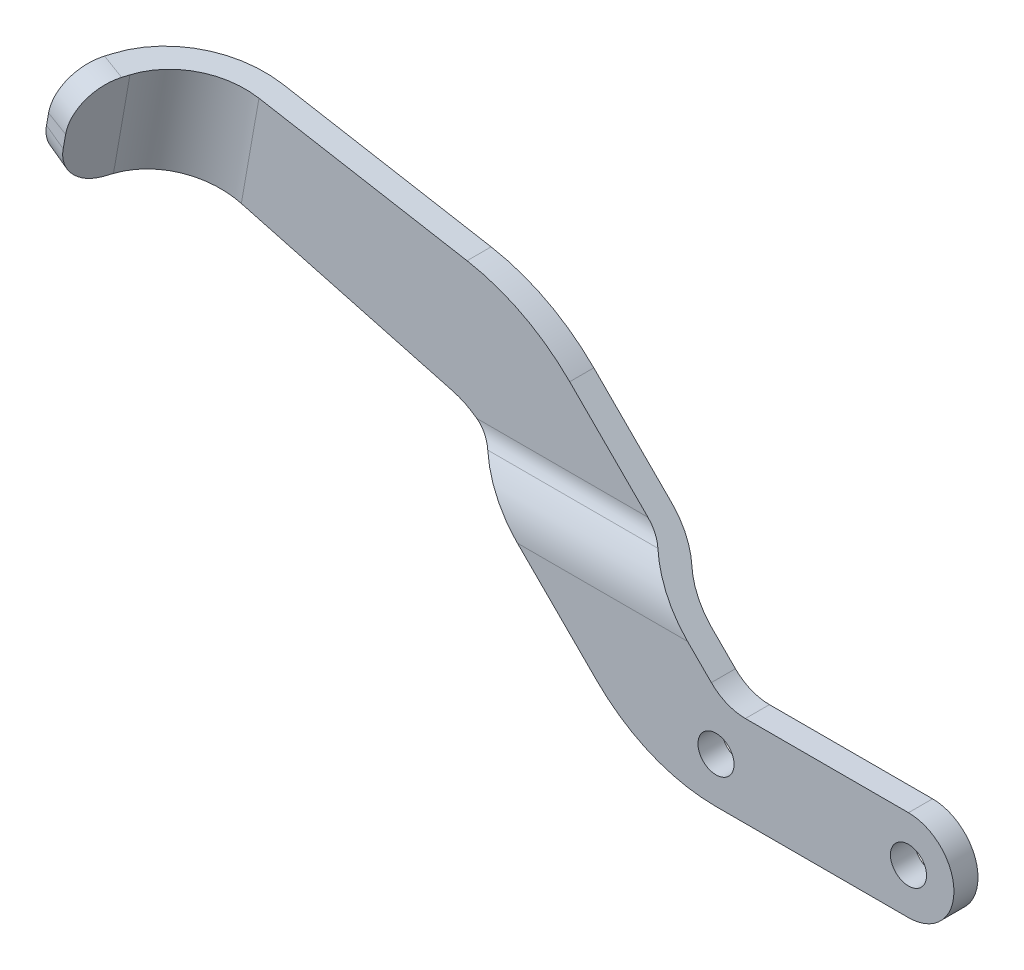
ISO-10303-21;
HEADER;
FILE_DESCRIPTION(('STEP AP214'),'2;1');
FILE_NAME('part.step','',(''),(''),'','','');
FILE_SCHEMA(('AUTOMOTIVE_DESIGN { 1 0 10303 214 1 1 1 1 }'));
ENDSEC;
DATA;
#1=APPLICATION_CONTEXT('core data for automotive mechanical design processes');
#2=APPLICATION_PROTOCOL_DEFINITION('international standard','automotive_design',2000,#1);
#3=PRODUCT_CONTEXT('',#1,'mechanical');
#4=PRODUCT('Part','Part','',(#3));
#5=PRODUCT_RELATED_PRODUCT_CATEGORY('part','',(#4));
#6=PRODUCT_DEFINITION_FORMATION('','',#4);
#7=PRODUCT_DEFINITION_CONTEXT('part definition',#1,'design');
#8=PRODUCT_DEFINITION('design','',#6,#7);
#9=PRODUCT_DEFINITION_SHAPE('','',#8);
#10=(LENGTH_UNIT() NAMED_UNIT(*) SI_UNIT(.MILLI.,.METRE.));
#11=(NAMED_UNIT(*) PLANE_ANGLE_UNIT() SI_UNIT($,.RADIAN.));
#12=(NAMED_UNIT(*) SI_UNIT($,.STERADIAN.) SOLID_ANGLE_UNIT());
#13=UNCERTAINTY_MEASURE_WITH_UNIT(LENGTH_MEASURE(1.E-05),#10,'distance_accuracy_value','');
#14=(GEOMETRIC_REPRESENTATION_CONTEXT(3) GLOBAL_UNCERTAINTY_ASSIGNED_CONTEXT((#13)) GLOBAL_UNIT_ASSIGNED_CONTEXT((#10,
#11,#12)) REPRESENTATION_CONTEXT('',''));
#15=CARTESIAN_POINT('',(0.,0.,0.));
#16=DIRECTION('',(0.,0.,1.));
#17=DIRECTION('',(1.,0.,0.));
#18=AXIS2_PLACEMENT_3D('',#15,#16,#17);
#19=CARTESIAN_POINT('',(-26.0151280605346,7.85987193946543,3.175));
#20=DIRECTION('',(-0.707106781186549,-0.707106781186546,0.));
#21=DIRECTION('',(0.707106781186546,-0.707106781186549,0.));
#22=AXIS2_PLACEMENT_3D('',#19,#20,#21);
#23=PLANE('',#22);
#24=CARTESIAN_POINT('',(-29.1549957084391,10.9997395873699,-6.35));
#25=DIRECTION('',(-0.707106781186549,-0.707106781186546,0.));
#26=DIRECTION('',(0.707106781186546,-0.707106781186549,0.));
#27=AXIS2_PLACEMENT_3D('',#24,#25,#26);
#28=ELLIPSE('',#27,13.4703841816037,9.525);
#29=CARTESIAN_POINT('',(-29.1549957084391,10.9997395873699,3.175));
#30=VERTEX_POINT('',#29);
#31=CARTESIAN_POINT('',(-35.4551910179116,17.2999348968425,0.793750000000002));
#32=VERTEX_POINT('',#31);
#33=EDGE_CURVE('E259',#30,#32,#28,.T.);
#34=ORIENTED_EDGE('',*,*,#33,.F.);
#35=DIRECTION('',(-0.707106781186546,0.707106781186549,0.));
#36=VECTOR('',#35,1.);
#37=CARTESIAN_POINT('',(-26.0151280605346,7.85987193946543,3.175));
#38=LINE('',#37,#36);
#39=CARTESIAN_POINT('',(-26.0151280605346,7.85987193946543,3.175));
#40=VERTEX_POINT('',#39);
#41=EDGE_CURVE('E337',#40,#30,#38,.T.);
#42=ORIENTED_EDGE('',*,*,#41,.F.);
#43=DIRECTION('',(0.,0.,-1.));
#44=VECTOR('',#43,1.);
#45=CARTESIAN_POINT('',(-26.0151280605346,7.85987193946543,3.175));
#46=LINE('',#45,#44);
#47=CARTESIAN_POINT('',(-26.0151280605346,7.85987193946543,0.));
#48=VERTEX_POINT('',#47);
#49=EDGE_CURVE('E369',#40,#48,#46,.T.);
#50=ORIENTED_EDGE('',*,*,#49,.T.);
#51=DIRECTION('',(-0.707106781186546,0.707106781186549,0.));
#52=VECTOR('',#51,1.);
#53=CARTESIAN_POINT('',(-26.0151280605346,7.85987193946543,0.));
#54=LINE('',#53,#52);
#55=CARTESIAN_POINT('',(-29.1549957084391,10.9997395873699,0.));
#56=VERTEX_POINT('',#55);
#57=EDGE_CURVE('E312',#48,#56,#54,.T.);
#58=ORIENTED_EDGE('',*,*,#57,.T.);
#59=CARTESIAN_POINT('',(-29.1549957084391,10.9997395873699,-6.35));
#60=DIRECTION('',(-0.707106781186549,-0.707106781186546,0.));
#61=DIRECTION('',(-0.707106781186546,0.707106781186549,0.));
#62=AXIS2_PLACEMENT_3D('',#59,#60,#61);
#63=ELLIPSE('',#62,8.98025612106914,6.35);
#64=CARTESIAN_POINT('',(-33.3551259147541,15.199869793685,-1.5875));
#65=VERTEX_POINT('',#64);
#66=EDGE_CURVE('E322',#56,#65,#63,.T.);
#67=ORIENTED_EDGE('',*,*,#66,.T.);
#68=CARTESIAN_POINT('',(-37.5552561210691,19.4,3.175));
#69=DIRECTION('',(-0.707106781186549,-0.707106781186546,0.));
#70=DIRECTION('',(-0.707106781186546,0.707106781186549,0.));
#71=AXIS2_PLACEMENT_3D('',#68,#69,#70);
#72=ELLIPSE('',#71,8.98025612106914,6.35);
#73=CARTESIAN_POINT('',(-37.5552561210691,19.4,-3.175));
#74=VERTEX_POINT('',#73);
#75=EDGE_CURVE('E302',#65,#74,#72,.F.);
#76=ORIENTED_EDGE('',*,*,#75,.T.);
#77=DIRECTION('',(-0.707106781186546,0.707106781186549,0.));
#78=VECTOR('',#77,1.);
#79=CARTESIAN_POINT('',(-26.0151280605346,7.85987193946543,-3.175));
#80=LINE('',#79,#78);
#81=CARTESIAN_POINT('',(-47.8835482141741,29.728292093105,-3.175));
#82=VERTEX_POINT('',#81);
#83=EDGE_CURVE('E329',#74,#82,#80,.T.);
#84=ORIENTED_EDGE('',*,*,#83,.T.);
#85=DIRECTION('',(0.,0.,-1.));
#86=VECTOR('',#85,1.);
#87=CARTESIAN_POINT('',(-47.8835482141741,29.728292093105,3.175));
#88=LINE('',#87,#86);
#89=CARTESIAN_POINT('',(-47.8835482141741,29.728292093105,0.));
#90=VERTEX_POINT('',#89);
#91=EDGE_CURVE('E372',#90,#82,#88,.T.);
#92=ORIENTED_EDGE('',*,*,#91,.F.);
#93=DIRECTION('',(0.707106781186546,-0.707106781186549,0.));
#94=VECTOR('',#93,1.);
#95=CARTESIAN_POINT('',(-26.0151280605346,7.85987193946543,0.));
#96=LINE('',#95,#94);
#97=CARTESIAN_POINT('',(-37.5552561210691,19.4,0.));
#98=VERTEX_POINT('',#97);
#99=EDGE_CURVE('E460',#90,#98,#96,.T.);
#100=ORIENTED_EDGE('',*,*,#99,.T.);
#101=CARTESIAN_POINT('',(-37.5552561210691,19.4,3.175));
#102=DIRECTION('',(-0.707106781186549,-0.707106781186546,0.));
#103=DIRECTION('',(0.707106781186546,-0.707106781186549,0.));
#104=AXIS2_PLACEMENT_3D('',#101,#102,#103);
#105=ELLIPSE('',#104,4.49012806053457,3.175);
#106=EDGE_CURVE('E270',#32,#98,#105,.F.);
#107=ORIENTED_EDGE('',*,*,#106,.F.);
#108=EDGE_LOOP('',(#34,#42,#50,#58,#67,#76,#84,#92,#100,#107));
#109=FACE_BOUND('',#108,.T.);
#110=ADVANCED_FACE('F45',(#109),#23,.F.);
#111=CARTESIAN_POINT('',(-65.8440604563124,11.7677798509667,3.175));
#112=DIRECTION('',(0.,0.,-1.));
#113=DIRECTION('',(-1.,0.,0.));
#114=AXIS2_PLACEMENT_3D('',#111,#112,#113);
#115=CYLINDRICAL_SURFACE('',#114,9.52500000000001);
#116=DIRECTION('',(0.,0.,-1.));
#117=VECTOR('',#116,1.);
#118=CARTESIAN_POINT('',(-59.1088683655106,18.5029719417686,3.175));
#119=LINE('',#118,#117);
#120=CARTESIAN_POINT('',(-59.1088683655106,18.5029719417686,0.129352997679215));
#121=VERTEX_POINT('',#120);
#122=CARTESIAN_POINT('',(-59.1088683655106,18.5029719417686,-3.1113217116805));
#123=VERTEX_POINT('',#122);
#124=EDGE_CURVE('E378',#121,#123,#119,.T.);
#125=ORIENTED_EDGE('',*,*,#124,.F.);
#126=CARTESIAN_POINT('',(-59.1088683655106,18.5029719417686,0.129352997679214));
#127=CARTESIAN_POINT('',(-59.1886792418234,18.5828004142644,0.105848736286279));
#128=CARTESIAN_POINT('',(-59.2704318916558,18.6616980958661,0.0860128643272615));
#129=CARTESIAN_POINT('',(-59.4371062268742,18.8168516372428,0.053007404663316));
#130=CARTESIAN_POINT('',(-59.5220143189027,18.893116595117,0.0398121361289758));
#131=CARTESIAN_POINT('',(-59.6948995496534,19.0428422283832,0.0192473264905239));
#132=CARTESIAN_POINT('',(-59.7828761994638,19.1163033466386,0.0118768617102921));
#133=CARTESIAN_POINT('',(-59.9619463224182,19.2604195171152,0.00224620935788169));
#134=CARTESIAN_POINT('',(-60.0530506400862,19.3310624707226,6.12148140675001E-06));
#135=CARTESIAN_POINT('',(-60.1453903836823,19.4,0.));
#136=B_SPLINE_CURVE_WITH_KNOTS('',3,(#126,#127,#128,#129,#130,#131,#132,#133,#134,#135),
.UNSPECIFIED.,.F.,.F.,(4,2,2,2,4),(0.,0.345762616395283,0.690177606879254,1.03453797032589,
1.38024517136542),.UNSPECIFIED.);
#137=CARTESIAN_POINT('',(-60.1453903836823,19.4,0.));
#138=VERTEX_POINT('',#137);
#139=EDGE_CURVE('E261',#121,#138,#136,.T.);
#140=ORIENTED_EDGE('',*,*,#139,.T.);
#141=CARTESIAN_POINT('',(-65.8440604563124,11.7677798509667,0.));
#142=DIRECTION('',(0.,0.,-1.));
#143=DIRECTION('',(-1.,0.,0.));
#144=AXIS2_PLACEMENT_3D('',#141,#142,#143);
#145=CIRCLE('',#144,9.52500000000001);
#146=CARTESIAN_POINT('',(-63.3788090517109,20.9682233463701,0.));
#147=VERTEX_POINT('',#146);
#148=EDGE_CURVE('E396',#147,#138,#145,.T.);
#149=ORIENTED_EDGE('',*,*,#148,.F.);
#150=DIRECTION('',(0.,0.,-1.));
#151=VECTOR('',#150,1.);
#152=CARTESIAN_POINT('',(-63.3788090517109,20.9682233463701,3.175));
#153=LINE('',#152,#151);
#154=CARTESIAN_POINT('',(-63.3788090517109,20.9682233463701,-3.175));
#155=VERTEX_POINT('',#154);
#156=EDGE_CURVE('E376',#147,#155,#153,.T.);
#157=ORIENTED_EDGE('',*,*,#156,.T.);
#158=CARTESIAN_POINT('',(-65.8440604563124,11.7677798509667,-3.175));
#159=DIRECTION('',(0.,0.,1.));
#160=DIRECTION('',(1.,0.,0.));
#161=AXIS2_PLACEMENT_3D('',#158,#159,#160);
#162=CIRCLE('',#161,9.52500000000001);
#163=CARTESIAN_POINT('',(-60.1453903836823,19.4,-3.175));
#164=VERTEX_POINT('',#163);
#165=EDGE_CURVE('E324',#164,#155,#162,.T.);
#166=ORIENTED_EDGE('',*,*,#165,.F.);
#167=CARTESIAN_POINT('',(-59.1088683655106,18.5029719417686,-3.1113217116805));
#168=CARTESIAN_POINT('',(-59.189505151597,18.583613825167,-3.12282841350219));
#169=CARTESIAN_POINT('',(-59.2717146733717,18.6629219050843,-3.13256262496471));
#170=CARTESIAN_POINT('',(-59.4389441454381,18.818532451764,-3.14880457763691));
#171=CARTESIAN_POINT('',(-59.5239583882968,18.8948404041585,-3.15531848630597));
#172=CARTESIAN_POINT('',(-59.6967706565378,19.044421600127,-3.16547983513595));
#173=CARTESIAN_POINT('',(-59.7845685842799,19.1176949499349,-3.16912737572188));
#174=CARTESIAN_POINT('',(-59.9629595247646,19.2612047935532,-3.17388938858678));
#175=CARTESIAN_POINT('',(-60.0535575957453,19.3314351657777,-3.17499896803526));
#176=CARTESIAN_POINT('',(-60.1453903836823,19.4,-3.175));
#177=B_SPLINE_CURVE_WITH_KNOTS('',3,(#167,#168,#169,#170,#171,#172,#173,#174,#175,#176),
.UNSPECIFIED.,.F.,.F.,(4,2,2,2,4),(0.,0.343814559628881,0.686968076684379,1.03010957060628,
1.37391203728518),.UNSPECIFIED.);
#178=EDGE_CURVE('E294',#123,#164,#177,.T.);
#179=ORIENTED_EDGE('',*,*,#178,.F.);
#180=EDGE_LOOP('',(#125,#140,#149,#157,#166,#179));
#181=FACE_BOUND('',#180,.T.);
#182=ADVANCED_FACE('F272',(#181),#115,.F.);
#183=CARTESIAN_POINT('',(-59.1088683655106,18.5029719417686,3.175));
#184=DIRECTION('',(0.707106781186549,0.707106781186546,0.));
#185=DIRECTION('',(-0.707106781186546,0.707106781186549,0.));
#186=AXIS2_PLACEMENT_3D('',#183,#184,#185);
#187=PLANE('',#186);
#188=CARTESIAN_POINT('',(-60.005896423742,19.4,3.175));
#189=DIRECTION('',(0.707106781186549,0.707106781186546,0.));
#190=DIRECTION('',(0.707106781186546,-0.707106781186549,0.));
#191=AXIS2_PLACEMENT_3D('',#188,#189,#190);
#192=ELLIPSE('',#191,4.49012806053456,3.175);
#193=CARTESIAN_POINT('',(-57.9058313205844,17.2999348968425,0.793750000000002));
#194=VERTEX_POINT('',#193);
#195=EDGE_CURVE('E394',#121,#194,#192,.F.);
#196=ORIENTED_EDGE('',*,*,#195,.F.);
#197=ORIENTED_EDGE('',*,*,#124,.T.);
#198=CARTESIAN_POINT('',(-60.005896423742,19.4,3.175));
#199=DIRECTION('',(0.707106781186549,0.707106781186546,0.));
#200=DIRECTION('',(-0.707106781186546,0.707106781186549,0.));
#201=AXIS2_PLACEMENT_3D('',#198,#199,#200);
#202=ELLIPSE('',#201,8.98025612106913,6.35);
#203=CARTESIAN_POINT('',(-55.8057662174269,15.199869793685,-1.5875));
#204=VERTEX_POINT('',#203);
#205=EDGE_CURVE('E303',#123,#204,#202,.F.);
#206=ORIENTED_EDGE('',*,*,#205,.T.);
#207=CARTESIAN_POINT('',(-51.6056360111119,10.9997395873699,-6.35));
#208=DIRECTION('',(0.707106781186549,0.707106781186546,0.));
#209=DIRECTION('',(-0.707106781186546,0.707106781186549,0.));
#210=AXIS2_PLACEMENT_3D('',#207,#208,#209);
#211=ELLIPSE('',#210,8.98025612106913,6.35);
#212=CARTESIAN_POINT('',(-51.6056360111119,10.9997395873699,0.));
#213=VERTEX_POINT('',#212);
#214=EDGE_CURVE('E390',#204,#213,#211,.T.);
#215=ORIENTED_EDGE('',*,*,#214,.T.);
#216=DIRECTION('',(0.707106781186546,-0.707106781186549,0.));
#217=VECTOR('',#216,1.);
#218=CARTESIAN_POINT('',(-59.1088683655106,18.5029719417686,0.));
#219=LINE('',#218,#217);
#220=CARTESIAN_POINT('',(-41.115448211871,0.509551788129007,0.));
#221=VERTEX_POINT('',#220);
#222=EDGE_CURVE('E310',#213,#221,#219,.T.);
#223=ORIENTED_EDGE('',*,*,#222,.T.);
#224=DIRECTION('',(0.,0.,-1.));
#225=VECTOR('',#224,1.);
#226=CARTESIAN_POINT('',(-41.115448211871,0.509551788129007,3.175));
#227=LINE('',#226,#225);
#228=CARTESIAN_POINT('',(-41.115448211871,0.509551788129007,3.175));
#229=VERTEX_POINT('',#228);
#230=EDGE_CURVE('E380',#229,#221,#227,.T.);
#231=ORIENTED_EDGE('',*,*,#230,.F.);
#232=DIRECTION('',(0.707106781186546,-0.707106781186549,0.));
#233=VECTOR('',#232,1.);
#234=CARTESIAN_POINT('',(-59.1088683655106,18.5029719417686,3.175));
#235=LINE('',#234,#233);
#236=CARTESIAN_POINT('',(-51.6056360111119,10.9997395873699,3.175));
#237=VERTEX_POINT('',#236);
#238=EDGE_CURVE('E335',#237,#229,#235,.T.);
#239=ORIENTED_EDGE('',*,*,#238,.F.);
#240=CARTESIAN_POINT('',(-51.6056360111119,10.9997395873699,-6.35));
#241=DIRECTION('',(0.707106781186549,0.707106781186546,0.));
#242=DIRECTION('',(0.707106781186546,-0.707106781186549,0.));
#243=AXIS2_PLACEMENT_3D('',#240,#241,#242);
#244=ELLIPSE('',#243,13.4703841816037,9.525);
#245=EDGE_CURVE('E257',#194,#237,#244,.T.);
#246=ORIENTED_EDGE('',*,*,#245,.F.);
#247=EDGE_LOOP('',(#196,#197,#206,#215,#223,#231,#239,#246));
#248=FACE_BOUND('',#247,.T.);
#249=ADVANCED_FACE('F487',(#248),#187,.F.);
#250=CARTESIAN_POINT('',(0.,0.,3.175));
#251=DIRECTION('',(0.,0.,-1.));
#252=DIRECTION('',(-1.,0.,0.));
#253=AXIS2_PLACEMENT_3D('',#250,#251,#252);
#254=PLANE('',#253);
#255=CARTESIAN_POINT('',(-25.4,0.,3.175));
#256=DIRECTION('',(0.,0.,1.));
#257=DIRECTION('',(1.,0.,0.));
#258=AXIS2_PLACEMENT_3D('',#255,#256,#257);
#259=CIRCLE('',#258,2.38125);
#260=CARTESIAN_POINT('',(-23.01875,0.,3.175));
#261=VERTEX_POINT('',#260);
#262=EDGE_CURVE('E229',#261,#261,#259,.T.);
#263=ORIENTED_EDGE('',*,*,#262,.F.);
#264=EDGE_LOOP('',(#263));
#265=FACE_BOUND('',#264,.T.);
#266=CARTESIAN_POINT('',(0.,0.,3.175));
#267=DIRECTION('',(0.,0.,1.));
#268=DIRECTION('',(1.,0.,0.));
#269=AXIS2_PLACEMENT_3D('',#266,#267,#268);
#270=CIRCLE('',#269,2.38125);
#271=CARTESIAN_POINT('',(2.38125,0.,3.175));
#272=VERTEX_POINT('',#271);
#273=EDGE_CURVE('E247',#272,#272,#270,.T.);
#274=ORIENTED_EDGE('',*,*,#273,.F.);
#275=EDGE_LOOP('',(#274));
#276=FACE_BOUND('',#275,.T.);
#277=DIRECTION('',(1.,0.,0.));
#278=VECTOR('',#277,1.);
#279=CARTESIAN_POINT('',(-91.2266301851405,10.9997395873699,3.175));
#280=LINE('',#279,#278);
#281=EDGE_CURVE('E392',#237,#30,#280,.T.);
#282=ORIENTED_EDGE('',*,*,#281,.F.);
#283=ORIENTED_EDGE('',*,*,#238,.T.);
#284=CARTESIAN_POINT('',(-25.4,16.225,3.175));
#285=DIRECTION('',(0.,0.,-1.));
#286=DIRECTION('',(-1.,0.,0.));
#287=AXIS2_PLACEMENT_3D('',#284,#285,#286);
#288=CIRCLE('',#287,22.225);
#289=CARTESIAN_POINT('',(-25.4,-6.,3.175));
#290=VERTEX_POINT('',#289);
#291=EDGE_CURVE('E332',#290,#229,#288,.T.);
#292=ORIENTED_EDGE('',*,*,#291,.F.);
#293=DIRECTION('',(-1.,0.,0.));
#294=VECTOR('',#293,1.);
#295=CARTESIAN_POINT('',(0.,-6.,3.175));
#296=LINE('',#295,#294);
#297=CARTESIAN_POINT('',(0.,-6.,3.175));
#298=VERTEX_POINT('',#297);
#299=EDGE_CURVE('E328',#298,#290,#296,.T.);
#300=ORIENTED_EDGE('',*,*,#299,.F.);
#301=CARTESIAN_POINT('',(0.,0.,3.175));
#302=DIRECTION('',(0.,0.,-1.));
#303=DIRECTION('',(-1.,0.,0.));
#304=AXIS2_PLACEMENT_3D('',#301,#302,#303);
#305=CIRCLE('',#304,6.);
#306=CARTESIAN_POINT('',(0.,6.,3.175));
#307=VERTEX_POINT('',#306);
#308=EDGE_CURVE('E325',#307,#298,#305,.T.);
#309=ORIENTED_EDGE('',*,*,#308,.F.);
#310=DIRECTION('',(-1.,0.,0.));
#311=VECTOR('',#310,1.);
#312=CARTESIAN_POINT('',(0.,6.,3.175));
#313=LINE('',#312,#311);
#314=CARTESIAN_POINT('',(-21.525,6.,3.175));
#315=VERTEX_POINT('',#314);
#316=EDGE_CURVE('E343',#307,#315,#313,.T.);
#317=ORIENTED_EDGE('',*,*,#316,.T.);
#318=CARTESIAN_POINT('',(-21.525,12.35,3.175));
#319=DIRECTION('',(0.,0.,1.));
#320=DIRECTION('',(1.,0.,0.));
#321=AXIS2_PLACEMENT_3D('',#318,#319,#320);
#322=CIRCLE('',#321,6.35);
#323=EDGE_CURVE('E340',#40,#315,#322,.T.);
#324=ORIENTED_EDGE('',*,*,#323,.F.);
#325=ORIENTED_EDGE('',*,*,#41,.T.);
#326=EDGE_LOOP('',(#282,#283,#292,#300,#309,#317,#324,#325));
#327=FACE_BOUND('',#326,.T.);
#328=ADVANCED_FACE('F500',(#265,#276,#327),#254,.F.);
#329=CARTESIAN_POINT('',(0.,0.,3.175));
#330=DIRECTION('',(0.,0.,-1.));
#331=DIRECTION('',(-1.,0.,0.));
#332=AXIS2_PLACEMENT_3D('',#329,#330,#331);
#333=CYLINDRICAL_SURFACE('',#332,6.);
#334=CARTESIAN_POINT('',(0.,0.,0.));
#335=DIRECTION('',(0.,0.,1.));
#336=DIRECTION('',(1.,0.,0.));
#337=AXIS2_PLACEMENT_3D('',#334,#335,#336);
#338=CIRCLE('',#337,6.);
#339=CARTESIAN_POINT('',(0.,6.,0.));
#340=VERTEX_POINT('',#339);
#341=CARTESIAN_POINT('',(0.,-6.,0.));
#342=VERTEX_POINT('',#341);
#343=EDGE_CURVE('E319',#340,#342,#338,.F.);
#344=ORIENTED_EDGE('',*,*,#343,.F.);
#345=DIRECTION('',(0.,0.,-1.));
#346=VECTOR('',#345,1.);
#347=CARTESIAN_POINT('',(0.,6.,3.175));
#348=LINE('',#347,#346);
#349=EDGE_CURVE('E362',#307,#340,#348,.T.);
#350=ORIENTED_EDGE('',*,*,#349,.F.);
#351=ORIENTED_EDGE('',*,*,#308,.T.);
#352=DIRECTION('',(0.,0.,-1.));
#353=VECTOR('',#352,1.);
#354=CARTESIAN_POINT('',(0.,-6.,3.175));
#355=LINE('',#354,#353);
#356=EDGE_CURVE('E345',#298,#342,#355,.T.);
#357=ORIENTED_EDGE('',*,*,#356,.T.);
#358=EDGE_LOOP('',(#344,#350,#351,#357));
#359=FACE_BOUND('',#358,.T.);
#360=ADVANCED_FACE('F502',(#359),#333,.T.);
#361=CARTESIAN_POINT('',(0.,6.,3.175));
#362=DIRECTION('',(0.,-1.,0.));
#363=DIRECTION('',(1.,0.,0.));
#364=AXIS2_PLACEMENT_3D('',#361,#362,#363);
#365=PLANE('',#364);
#366=ORIENTED_EDGE('',*,*,#349,.T.);
#367=DIRECTION('',(-1.,0.,0.));
#368=VECTOR('',#367,1.);
#369=CARTESIAN_POINT('',(0.,6.,0.));
#370=LINE('',#369,#368);
#371=CARTESIAN_POINT('',(-21.525,6.,0.));
#372=VERTEX_POINT('',#371);
#373=EDGE_CURVE('E317',#340,#372,#370,.T.);
#374=ORIENTED_EDGE('',*,*,#373,.T.);
#375=DIRECTION('',(0.,0.,-1.));
#376=VECTOR('',#375,1.);
#377=CARTESIAN_POINT('',(-21.525,6.,3.175));
#378=LINE('',#377,#376);
#379=EDGE_CURVE('E366',#315,#372,#378,.T.);
#380=ORIENTED_EDGE('',*,*,#379,.F.);
#381=ORIENTED_EDGE('',*,*,#316,.F.);
#382=EDGE_LOOP('',(#366,#374,#380,#381));
#383=FACE_BOUND('',#382,.T.);
#384=ADVANCED_FACE('F506',(#383),#365,.F.);
#385=CARTESIAN_POINT('',(-21.525,12.35,3.175));
#386=DIRECTION('',(0.,0.,-1.));
#387=DIRECTION('',(-1.,0.,0.));
#388=AXIS2_PLACEMENT_3D('',#385,#386,#387);
#389=CYLINDRICAL_SURFACE('',#388,6.35);
#390=CARTESIAN_POINT('',(-21.525,12.35,0.));
#391=DIRECTION('',(0.,0.,1.));
#392=DIRECTION('',(1.,0.,0.));
#393=AXIS2_PLACEMENT_3D('',#390,#391,#392);
#394=CIRCLE('',#393,6.35);
#395=EDGE_CURVE('E314',#48,#372,#394,.T.);
#396=ORIENTED_EDGE('',*,*,#395,.F.);
#397=ORIENTED_EDGE('',*,*,#49,.F.);
#398=ORIENTED_EDGE('',*,*,#323,.T.);
#399=ORIENTED_EDGE('',*,*,#379,.T.);
#400=EDGE_LOOP('',(#396,#397,#398,#399));
#401=FACE_BOUND('',#400,.T.);
#402=ADVANCED_FACE('F510',(#401),#389,.F.);
#403=CARTESIAN_POINT('',(-65.8440604563124,11.7677798509667,3.175));
#404=DIRECTION('',(0.,0.,-1.));
#405=DIRECTION('',(-1.,0.,0.));
#406=AXIS2_PLACEMENT_3D('',#403,#404,#405);
#407=CYLINDRICAL_SURFACE('',#406,25.4);
#408=DIRECTION('',(0.,0.,-1.));
#409=VECTOR('',#408,1.);
#410=CARTESIAN_POINT('',(-61.4333967435724,36.7818967774768,3.175));
#411=LINE('',#410,#409);
#412=CARTESIAN_POINT('',(-61.4333967435724,36.7818967774768,0.));
#413=VERTEX_POINT('',#412);
#414=CARTESIAN_POINT('',(-61.4333967435724,36.7818967774768,-3.175));
#415=VERTEX_POINT('',#414);
#416=EDGE_CURVE('E374',#413,#415,#411,.T.);
#417=ORIENTED_EDGE('',*,*,#416,.F.);
#418=CARTESIAN_POINT('',(-65.8440604563124,11.7677798509667,0.));
#419=DIRECTION('',(0.,0.,-1.));
#420=DIRECTION('',(-1.,0.,0.));
#421=AXIS2_PLACEMENT_3D('',#418,#419,#420);
#422=CIRCLE('',#421,25.4);
#423=EDGE_CURVE('E463',#413,#90,#422,.T.);
#424=ORIENTED_EDGE('',*,*,#423,.T.);
#425=ORIENTED_EDGE('',*,*,#91,.T.);
#426=CARTESIAN_POINT('',(-65.8440604563124,11.7677798509667,-3.175));
#427=DIRECTION('',(0.,0.,1.));
#428=DIRECTION('',(1.,0.,0.));
#429=AXIS2_PLACEMENT_3D('',#426,#427,#428);
#430=CIRCLE('',#429,25.4);
#431=EDGE_CURVE('E357',#82,#415,#430,.T.);
#432=ORIENTED_EDGE('',*,*,#431,.T.);
#433=EDGE_LOOP('',(#417,#424,#425,#432));
#434=FACE_BOUND('',#433,.T.);
#435=ADVANCED_FACE('F480',(#434),#407,.T.);
#436=CARTESIAN_POINT('',(-61.4333967435724,36.7818967774768,3.175));
#437=DIRECTION('',(-0.17364817766693,-0.984807753012208,0.));
#438=DIRECTION('',(0.984807753012208,-0.17364817766693,0.));
#439=AXIS2_PLACEMENT_3D('',#436,#437,#438);
#440=PLANE('',#439);
#441=DIRECTION('',(-0.241580615484602,0.0425971805260925,0.969445349895139));
#442=VECTOR('',#441,1.);
#443=CARTESIAN_POINT('',(-101.437156596784,43.8356389693801,6.73547247011678));
#444=LINE('',#443,#442);
#445=CARTESIAN_POINT('',(-101.437156596784,43.8356389693801,6.73547247011678));
#446=VERTEX_POINT('',#445);
#447=CARTESIAN_POINT('',(-101.658057911583,43.8745898312532,7.6219332980609));
#448=VERTEX_POINT('',#447);
#449=EDGE_CURVE('E235',#446,#448,#444,.T.);
#450=ORIENTED_EDGE('',*,*,#449,.T.);
#451=DIRECTION('',(0.954717296698367,-0.168342418356971,0.245307385878799));
#452=VECTOR('',#451,1.);
#453=CARTESIAN_POINT('',(-98.6268304945654,43.3401026529698,8.40078424822608));
#454=LINE('',#453,#452);
#455=CARTESIAN_POINT('',(-98.6268304945654,43.3401026529698,8.40078424822609));
#456=VERTEX_POINT('',#455);
#457=EDGE_CURVE('E398',#448,#456,#454,.T.);
#458=ORIENTED_EDGE('',*,*,#457,.T.);
#459=DIRECTION('',(0.241580615484602,-0.0425971805260914,-0.969445349895139));
#460=VECTOR('',#459,1.);
#461=CARTESIAN_POINT('',(-99.9154214975603,43.567316013896,13.5718057445668));
#462=LINE('',#461,#460);
#463=CARTESIAN_POINT('',(-98.4059291797663,43.3011517910967,7.51432342028197));
#464=VERTEX_POINT('',#463);
#465=EDGE_CURVE('E230',#456,#464,#462,.T.);
#466=ORIENTED_EDGE('',*,*,#465,.T.);
#467=CARTESIAN_POINT('',(-88.9,41.625,9.9568));
#468=DIRECTION('',(0.17364817766693,0.984807753012208,0.));
#469=DIRECTION('',(-0.984807753012208,0.17364817766693,0.));
#470=AXIS2_PLACEMENT_3D('',#467,#468,#469);
#471=CIRCLE('',#470,9.95679999999999);
#472=CARTESIAN_POINT('',(-88.9,41.625,0.));
#473=VERTEX_POINT('',#472);
#474=EDGE_CURVE('E216',#473,#464,#471,.T.);
#475=ORIENTED_EDGE('',*,*,#474,.F.);
#476=DIRECTION('',(0.984807753012208,-0.17364817766693,0.));
#477=VECTOR('',#476,1.);
#478=CARTESIAN_POINT('',(-61.4333967435724,36.7818967774768,0.));
#479=LINE('',#478,#477);
#480=EDGE_CURVE('E466',#473,#413,#479,.T.);
#481=ORIENTED_EDGE('',*,*,#480,.T.);
#482=ORIENTED_EDGE('',*,*,#416,.T.);
#483=DIRECTION('',(-0.984807753012208,0.17364817766693,0.));
#484=VECTOR('',#483,1.);
#485=CARTESIAN_POINT('',(-61.4333967435724,36.7818967774768,-3.175));
#486=LINE('',#485,#484);
#487=CARTESIAN_POINT('',(-88.9,41.625,-3.175));
#488=VERTEX_POINT('',#487);
#489=EDGE_CURVE('E354',#415,#488,#486,.T.);
#490=ORIENTED_EDGE('',*,*,#489,.T.);
#491=CARTESIAN_POINT('',(-88.9,41.625,9.9568));
#492=DIRECTION('',(0.17364817766693,0.984807753012208,0.));
#493=DIRECTION('',(-0.984807753012208,0.17364817766693,0.));
#494=AXIS2_PLACEMENT_3D('',#491,#492,#493);
#495=CIRCLE('',#494,13.1318);
#496=EDGE_CURVE('E245',#488,#446,#495,.T.);
#497=ORIENTED_EDGE('',*,*,#496,.T.);
#498=EDGE_LOOP('',(#450,#458,#466,#475,#481,#482,#490,#497));
#499=FACE_BOUND('',#498,.T.);
#500=ADVANCED_FACE('F423',(#499),#440,.F.);
#501=CARTESIAN_POINT('',(-63.3788090517109,20.9682233463701,3.175));
#502=DIRECTION('',(-0.258819045102521,-0.965925826289068,0.));
#503=DIRECTION('',(0.965925826289068,-0.258819045102521,0.));
#504=AXIS2_PLACEMENT_3D('',#501,#502,#503);
#505=PLANE('',#504);
#506=DIRECTION('',(0.237799086154686,-0.0637180730960073,-0.969222163275752));
#507=VECTOR('',#506,1.);
#508=CARTESIAN_POINT('',(-101.957856591592,31.3054479794431,13.1060863516145));
#509=LINE('',#508,#507);
#510=CARTESIAN_POINT('',(-100.830533645396,31.0033827064008,8.51134041591392));
#511=VERTEX_POINT('',#510);
#512=CARTESIAN_POINT('',(-100.585915084837,30.9378373606455,7.51432342028197));
#513=VERTEX_POINT('',#512);
#514=EDGE_CURVE('E207',#511,#513,#509,.T.);
#515=ORIENTED_EDGE('',*,*,#514,.F.);
#516=DIRECTION('',(0.936626392077294,-0.250968285366787,0.244429788291702));
#517=VECTOR('',#516,1.);
#518=CARTESIAN_POINT('',(-66.8380953692562,21.8951363215444,17.3822889196476));
#519=LINE('',#518,#517);
#520=CARTESIAN_POINT('',(-103.814999493513,31.8030679202422,7.73248946574873));
#521=VERTEX_POINT('',#520);
#522=EDGE_CURVE('E11',#511,#521,#519,.F.);
#523=ORIENTED_EDGE('',*,*,#522,.T.);
#524=DIRECTION('',(-0.237799086154687,0.0637180730960074,0.969222163275752));
#525=VECTOR('',#524,1.);
#526=CARTESIAN_POINT('',(-103.455426691861,31.7067206784192,6.2669416610528));
#527=LINE('',#526,#525);
#528=CARTESIAN_POINT('',(-103.570380932955,31.7375225744868,6.73547247011678));
#529=VERTEX_POINT('',#528);
#530=EDGE_CURVE('E240',#529,#521,#527,.T.);
#531=ORIENTED_EDGE('',*,*,#530,.F.);
#532=CARTESIAN_POINT('',(-91.2266301851405,28.4300245300389,9.9568));
#533=DIRECTION('',(-0.258819045102521,-0.965925826289068,0.));
#534=DIRECTION('',(-0.965925826289068,0.258819045102521,0.));
#535=AXIS2_PLACEMENT_3D('',#532,#533,#534);
#536=ELLIPSE('',#535,13.1819613426517,13.1318);
#537=CARTESIAN_POINT('',(-91.2266301851405,28.4300245300389,-3.175));
#538=VERTEX_POINT('',#537);
#539=EDGE_CURVE('E243',#538,#529,#536,.F.);
#540=ORIENTED_EDGE('',*,*,#539,.F.);
#541=DIRECTION('',(-0.965925826289068,0.258819045102521,0.));
#542=VECTOR('',#541,1.);
#543=CARTESIAN_POINT('',(-63.3788090517109,20.9682233463701,-3.175));
#544=LINE('',#543,#542);
#545=EDGE_CURVE('E348',#155,#538,#544,.T.);
#546=ORIENTED_EDGE('',*,*,#545,.F.);
#547=ORIENTED_EDGE('',*,*,#156,.F.);
#548=DIRECTION('',(0.965925826289068,-0.258819045102521,0.));
#549=VECTOR('',#548,1.);
#550=CARTESIAN_POINT('',(-63.3788090517109,20.9682233463701,0.));
#551=LINE('',#550,#549);
#552=CARTESIAN_POINT('',(-91.2266301851405,28.4300245300389,0.));
#553=VERTEX_POINT('',#552);
#554=EDGE_CURVE('E228',#553,#147,#551,.T.);
#555=ORIENTED_EDGE('',*,*,#554,.F.);
#556=CARTESIAN_POINT('',(-91.2266301851405,28.4300245300389,9.9568));
#557=DIRECTION('',(-0.258819045102521,-0.965925826289068,0.));
#558=DIRECTION('',(-0.965925826289068,0.258819045102521,0.));
#559=AXIS2_PLACEMENT_3D('',#556,#557,#558);
#560=ELLIPSE('',#559,9.9948333584516,9.95679999999999);
#561=EDGE_CURVE('E220',#553,#513,#560,.F.);
#562=ORIENTED_EDGE('',*,*,#561,.T.);
#563=EDGE_LOOP('',(#515,#523,#531,#540,#546,#547,#555,#562));
#564=FACE_BOUND('',#563,.T.);
#565=ADVANCED_FACE('F226',(#564),#505,.T.);
#566=CARTESIAN_POINT('',(-25.4,16.225,3.175));
#567=DIRECTION('',(0.,0.,-1.));
#568=DIRECTION('',(-1.,0.,0.));
#569=AXIS2_PLACEMENT_3D('',#566,#567,#568);
#570=CYLINDRICAL_SURFACE('',#569,22.225);
#571=CARTESIAN_POINT('',(-25.4,16.225,0.));
#572=DIRECTION('',(0.,0.,1.));
#573=DIRECTION('',(1.,0.,0.));
#574=AXIS2_PLACEMENT_3D('',#571,#572,#573);
#575=CIRCLE('',#574,22.225);
#576=CARTESIAN_POINT('',(-25.4,-6.,0.));
#577=VERTEX_POINT('',#576);
#578=EDGE_CURVE('E307',#577,#221,#575,.F.);
#579=ORIENTED_EDGE('',*,*,#578,.F.);
#580=DIRECTION('',(0.,0.,-1.));
#581=VECTOR('',#580,1.);
#582=CARTESIAN_POINT('',(-25.4,-6.,3.175));
#583=LINE('',#582,#581);
#584=EDGE_CURVE('E383',#290,#577,#583,.T.);
#585=ORIENTED_EDGE('',*,*,#584,.F.);
#586=ORIENTED_EDGE('',*,*,#291,.T.);
#587=ORIENTED_EDGE('',*,*,#230,.T.);
#588=EDGE_LOOP('',(#579,#585,#586,#587));
#589=FACE_BOUND('',#588,.T.);
#590=ADVANCED_FACE('F492',(#589),#570,.T.);
#591=CARTESIAN_POINT('',(0.,-6.,3.175));
#592=DIRECTION('',(0.,-1.,0.));
#593=DIRECTION('',(1.,0.,0.));
#594=AXIS2_PLACEMENT_3D('',#591,#592,#593);
#595=PLANE('',#594);
#596=DIRECTION('',(-1.,0.,0.));
#597=VECTOR('',#596,1.);
#598=CARTESIAN_POINT('',(135.562950910719,-6.,0.));
#599=LINE('',#598,#597);
#600=EDGE_CURVE('E452',#342,#577,#599,.T.);
#601=ORIENTED_EDGE('',*,*,#600,.F.);
#602=ORIENTED_EDGE('',*,*,#356,.F.);
#603=ORIENTED_EDGE('',*,*,#299,.T.);
#604=ORIENTED_EDGE('',*,*,#584,.T.);
#605=EDGE_LOOP('',(#601,#602,#603,#604));
#606=FACE_BOUND('',#605,.T.);
#607=ADVANCED_FACE('F495',(#606),#595,.T.);
#608=CARTESIAN_POINT('',(0.,0.,-3.175));
#609=DIRECTION('',(0.,0.,-1.));
#610=DIRECTION('',(-1.,0.,0.));
#611=AXIS2_PLACEMENT_3D('',#608,#609,#610);
#612=PLANE('',#611);
#613=DIRECTION('',(-1.,0.,0.));
#614=VECTOR('',#613,1.);
#615=CARTESIAN_POINT('',(135.562950910719,19.4,-3.175));
#616=LINE('',#615,#614);
#617=EDGE_CURVE('E365',#164,#74,#616,.F.);
#618=ORIENTED_EDGE('',*,*,#617,.F.);
#619=ORIENTED_EDGE('',*,*,#165,.T.);
#620=ORIENTED_EDGE('',*,*,#545,.T.);
#621=DIRECTION('',(0.173648177666931,0.984807753012208,0.));
#622=VECTOR('',#621,1.);
#623=CARTESIAN_POINT('',(-91.2266301851405,28.4300245300389,-3.175));
#624=LINE('',#623,#622);
#625=EDGE_CURVE('E351',#538,#488,#624,.T.);
#626=ORIENTED_EDGE('',*,*,#625,.T.);
#627=ORIENTED_EDGE('',*,*,#489,.F.);
#628=ORIENTED_EDGE('',*,*,#431,.F.);
#629=ORIENTED_EDGE('',*,*,#83,.F.);
#630=EDGE_LOOP('',(#618,#619,#620,#626,#627,#628,#629));
#631=FACE_BOUND('',#630,.T.);
#632=ADVANCED_FACE('F438',(#631),#612,.T.);
#633=CARTESIAN_POINT('',(135.562950910719,10.9997395873699,-6.35));
#634=DIRECTION('',(-1.,0.,0.));
#635=DIRECTION('',(0.,0.,1.));
#636=AXIS2_PLACEMENT_3D('',#633,#634,#635);
#637=CYLINDRICAL_SURFACE('',#636,6.35);
#638=ORIENTED_EDGE('',*,*,#66,.F.);
#639=DIRECTION('',(-1.,0.,0.));
#640=VECTOR('',#639,1.);
#641=CARTESIAN_POINT('',(135.562950910719,10.9997395873699,0.));
#642=LINE('',#641,#640);
#643=EDGE_CURVE('E454',#56,#213,#642,.T.);
#644=ORIENTED_EDGE('',*,*,#643,.T.);
#645=ORIENTED_EDGE('',*,*,#214,.F.);
#646=DIRECTION('',(-1.,0.,0.));
#647=VECTOR('',#646,1.);
#648=CARTESIAN_POINT('',(135.562950910719,15.199869793685,-1.5875));
#649=LINE('',#648,#647);
#650=EDGE_CURVE('E449',#65,#204,#649,.T.);
#651=ORIENTED_EDGE('',*,*,#650,.F.);
#652=EDGE_LOOP('',(#638,#644,#645,#651));
#653=FACE_BOUND('',#652,.T.);
#654=ADVANCED_FACE('F291',(#653),#637,.F.);
#655=CARTESIAN_POINT('',(135.562950910719,-6.,0.));
#656=DIRECTION('',(0.,0.,1.));
#657=DIRECTION('',(1.,0.,0.));
#658=AXIS2_PLACEMENT_3D('',#655,#656,#657);
#659=PLANE('',#658);
#660=CARTESIAN_POINT('',(-25.4,0.,0.));
#661=DIRECTION('',(0.,0.,1.));
#662=DIRECTION('',(1.,0.,0.));
#663=AXIS2_PLACEMENT_3D('',#660,#661,#662);
#664=CIRCLE('',#663,2.38125);
#665=CARTESIAN_POINT('',(-23.01875,0.,0.));
#666=VERTEX_POINT('',#665);
#667=EDGE_CURVE('E233',#666,#666,#664,.T.);
#668=ORIENTED_EDGE('',*,*,#667,.T.);
#669=EDGE_LOOP('',(#668));
#670=FACE_BOUND('',#669,.T.);
#671=CARTESIAN_POINT('',(0.,0.,0.));
#672=DIRECTION('',(0.,0.,1.));
#673=DIRECTION('',(1.,0.,0.));
#674=AXIS2_PLACEMENT_3D('',#671,#672,#673);
#675=CIRCLE('',#674,2.38125);
#676=CARTESIAN_POINT('',(2.38125,0.,0.));
#677=VERTEX_POINT('',#676);
#678=EDGE_CURVE('E250',#677,#677,#675,.T.);
#679=ORIENTED_EDGE('',*,*,#678,.T.);
#680=EDGE_LOOP('',(#679));
#681=FACE_BOUND('',#680,.T.);
#682=ORIENTED_EDGE('',*,*,#373,.F.);
#683=ORIENTED_EDGE('',*,*,#343,.T.);
#684=ORIENTED_EDGE('',*,*,#600,.T.);
#685=ORIENTED_EDGE('',*,*,#578,.T.);
#686=ORIENTED_EDGE('',*,*,#222,.F.);
#687=ORIENTED_EDGE('',*,*,#643,.F.);
#688=ORIENTED_EDGE('',*,*,#57,.F.);
#689=ORIENTED_EDGE('',*,*,#395,.T.);
#690=EDGE_LOOP('',(#682,#683,#684,#685,#686,#687,#688,#689));
#691=FACE_BOUND('',#690,.T.);
#692=ADVANCED_FACE('F289',(#670,#681,#691),#659,.F.);
#693=CARTESIAN_POINT('',(135.562950910719,19.4,3.175));
#694=DIRECTION('',(-1.,0.,0.));
#695=DIRECTION('',(0.,0.,1.));
#696=AXIS2_PLACEMENT_3D('',#693,#694,#695);
#697=CYLINDRICAL_SURFACE('',#696,6.35);
#698=ORIENTED_EDGE('',*,*,#75,.F.);
#699=ORIENTED_EDGE('',*,*,#650,.T.);
#700=ORIENTED_EDGE('',*,*,#205,.F.);
#701=ORIENTED_EDGE('',*,*,#178,.T.);
#702=ORIENTED_EDGE('',*,*,#617,.T.);
#703=EDGE_LOOP('',(#698,#699,#700,#701,#702));
#704=FACE_BOUND('',#703,.T.);
#705=ADVANCED_FACE('F285',(#704),#697,.T.);
#706=CARTESIAN_POINT('',(-91.2266301851405,19.4,0.));
#707=DIRECTION('',(0.,0.,-1.));
#708=DIRECTION('',(-1.,0.,0.));
#709=AXIS2_PLACEMENT_3D('',#706,#707,#708);
#710=PLANE('',#709);
#711=ORIENTED_EDGE('',*,*,#423,.F.);
#712=ORIENTED_EDGE('',*,*,#480,.F.);
#713=DIRECTION('',(-0.173648177666931,-0.984807753012208,0.));
#714=VECTOR('',#713,1.);
#715=CARTESIAN_POINT('',(-91.2266301851405,28.4300245300389,0.));
#716=LINE('',#715,#714);
#717=EDGE_CURVE('E469',#473,#553,#716,.T.);
#718=ORIENTED_EDGE('',*,*,#717,.T.);
#719=ORIENTED_EDGE('',*,*,#554,.T.);
#720=ORIENTED_EDGE('',*,*,#148,.T.);
#721=DIRECTION('',(1.,0.,0.));
#722=VECTOR('',#721,1.);
#723=CARTESIAN_POINT('',(-91.2266301851405,19.4,0.));
#724=LINE('',#723,#722);
#725=EDGE_CURVE('E251',#138,#98,#724,.T.);
#726=ORIENTED_EDGE('',*,*,#725,.T.);
#727=ORIENTED_EDGE('',*,*,#99,.F.);
#728=EDGE_LOOP('',(#711,#712,#718,#719,#720,#726,#727));
#729=FACE_BOUND('',#728,.T.);
#730=ADVANCED_FACE('F282',(#729),#710,.F.);
#731=CARTESIAN_POINT('',(-91.2266301851405,19.4,3.175));
#732=DIRECTION('',(1.,0.,0.));
#733=DIRECTION('',(0.,0.,-1.));
#734=AXIS2_PLACEMENT_3D('',#731,#732,#733);
#735=CYLINDRICAL_SURFACE('',#734,3.175);
#736=ORIENTED_EDGE('',*,*,#106,.T.);
#737=ORIENTED_EDGE('',*,*,#725,.F.);
#738=ORIENTED_EDGE('',*,*,#139,.F.);
#739=ORIENTED_EDGE('',*,*,#195,.T.);
#740=DIRECTION('',(1.,0.,0.));
#741=VECTOR('',#740,1.);
#742=CARTESIAN_POINT('',(-91.2266301851405,17.2999348968425,0.793750000000002));
#743=LINE('',#742,#741);
#744=EDGE_CURVE('E254',#194,#32,#743,.T.);
#745=ORIENTED_EDGE('',*,*,#744,.T.);
#746=EDGE_LOOP('',(#736,#737,#738,#739,#745));
#747=FACE_BOUND('',#746,.T.);
#748=ADVANCED_FACE('F276',(#747),#735,.F.);
#749=CARTESIAN_POINT('',(-91.2266301851405,10.9997395873699,-6.35));
#750=DIRECTION('',(1.,0.,0.));
#751=DIRECTION('',(0.,0.,-1.));
#752=AXIS2_PLACEMENT_3D('',#749,#750,#751);
#753=CYLINDRICAL_SURFACE('',#752,9.525);
#754=ORIENTED_EDGE('',*,*,#33,.T.);
#755=ORIENTED_EDGE('',*,*,#744,.F.);
#756=ORIENTED_EDGE('',*,*,#245,.T.);
#757=ORIENTED_EDGE('',*,*,#281,.T.);
#758=EDGE_LOOP('',(#754,#755,#756,#757));
#759=FACE_BOUND('',#758,.T.);
#760=ADVANCED_FACE('F281',(#759),#753,.T.);
#761=CARTESIAN_POINT('',(0.,0.,-3.175));
#762=DIRECTION('',(0.,0.,1.));
#763=DIRECTION('',(1.,0.,0.));
#764=AXIS2_PLACEMENT_3D('',#761,#762,#763);
#765=CYLINDRICAL_SURFACE('',#764,2.38125);
#766=ORIENTED_EDGE('',*,*,#273,.T.);
#767=EDGE_LOOP('',(#766));
#768=FACE_BOUND('',#767,.T.);
#769=ORIENTED_EDGE('',*,*,#678,.F.);
#770=EDGE_LOOP('',(#769));
#771=FACE_BOUND('',#770,.T.);
#772=ADVANCED_FACE('F515',(#768,#771),#765,.F.);
#773=CARTESIAN_POINT('',(-25.4,0.,-3.175));
#774=DIRECTION('',(0.,0.,1.));
#775=DIRECTION('',(1.,0.,0.));
#776=AXIS2_PLACEMENT_3D('',#773,#774,#775);
#777=CYLINDRICAL_SURFACE('',#776,2.38125);
#778=ORIENTED_EDGE('',*,*,#262,.T.);
#779=EDGE_LOOP('',(#778));
#780=FACE_BOUND('',#779,.T.);
#781=ORIENTED_EDGE('',*,*,#667,.F.);
#782=EDGE_LOOP('',(#781));
#783=FACE_BOUND('',#782,.T.);
#784=ADVANCED_FACE('F519',(#780,#783),#777,.F.);
#785=CARTESIAN_POINT('',(-94.9454386326458,7.3396137910615,9.9568));
#786=DIRECTION('',(0.17364817766693,0.984807753012208,0.));
#787=DIRECTION('',(-0.984807753012208,0.17364817766693,0.));
#788=AXIS2_PLACEMENT_3D('',#785,#786,#787);
#789=CYLINDRICAL_SURFACE('',#788,9.95679999999999);
#790=ORIENTED_EDGE('',*,*,#561,.F.);
#791=ORIENTED_EDGE('',*,*,#717,.F.);
#792=ORIENTED_EDGE('',*,*,#474,.T.);
#793=DIRECTION('',(0.17364817766693,0.984807753012208,0.));
#794=VECTOR('',#793,1.);
#795=CARTESIAN_POINT('',(-104.451367812412,9.01576558215819,7.51432342028197));
#796=LINE('',#795,#794);
#797=EDGE_CURVE('E211',#513,#464,#796,.T.);
#798=ORIENTED_EDGE('',*,*,#797,.F.);
#799=EDGE_LOOP('',(#790,#791,#792,#798));
#800=FACE_BOUND('',#799,.T.);
#801=ADVANCED_FACE('F219',(#800),#789,.F.);
#802=CARTESIAN_POINT('',(-105.960860130206,9.28192980495742,13.5718057445668));
#803=DIRECTION('',(0.954717296698366,-0.168342418356971,0.245307385878802));
#804=DIRECTION('',(0.248858956984574,0.,-0.968539735647717));
#805=AXIS2_PLACEMENT_3D('',#802,#803,#804);
#806=PLANE('',#805);
#807=ORIENTED_EDGE('',*,*,#465,.F.);
#808=CARTESIAN_POINT('',(-99.5530698742408,38.0871380984026,8.40078424822608));
#809=DIRECTION('',(0.954717296698366,-0.168342418356971,0.245307385878802));
#810=DIRECTION('',(0.248858956984574,0.,-0.968539735647717));
#811=AXIS2_PLACEMENT_3D('',#808,#809,#810);
#812=CIRCLE('',#811,5.334);
#813=CARTESIAN_POINT('',(-100.841660877236,38.3143514593288,13.5718057445668));
#814=VERTEX_POINT('',#813);
#815=EDGE_CURVE('E406',#456,#814,#812,.T.);
#816=ORIENTED_EDGE('',*,*,#815,.T.);
#817=DIRECTION('',(0.17364817766693,0.984807753012208,0.));
#818=VECTOR('',#817,1.);
#819=CARTESIAN_POINT('',(-105.960860130206,9.28192980495742,13.5718057445668));
#820=LINE('',#819,#818);
#821=CARTESIAN_POINT('',(-101.162222180151,36.4963579700341,13.5718057445668));
#822=VERTEX_POINT('',#821);
#823=EDGE_CURVE('E223',#822,#814,#820,.T.);
#824=ORIENTED_EDGE('',*,*,#823,.F.);
#825=CARTESIAN_POINT('',(-99.8736311771558,36.2691446091079,8.40078424822608));
#826=DIRECTION('',(0.954717296698366,-0.168342418356971,0.245307385878802));
#827=DIRECTION('',(-0.17364817766692,-0.98480775301221,0.));
#828=AXIS2_PLACEMENT_3D('',#825,#826,#827);
#829=ELLIPSE('',#828,5.35315112541024,5.334);
#830=EDGE_CURVE('E214',#822,#511,#829,.T.);
#831=ORIENTED_EDGE('',*,*,#830,.T.);
#832=ORIENTED_EDGE('',*,*,#514,.T.);
#833=ORIENTED_EDGE('',*,*,#797,.T.);
#834=EDGE_LOOP('',(#807,#816,#824,#831,#832,#833));
#835=FACE_BOUND('',#834,.T.);
#836=ADVANCED_FACE('F210',(#835),#806,.T.);
#837=CARTESIAN_POINT('',(-108.992087547223,9.8164169832408,12.7929547944016));
#838=DIRECTION('',(-0.241580615484598,0.0425971805260919,0.96944534989514));
#839=DIRECTION('',(0.970326087549228,0.,0.241800090614969));
#840=AXIS2_PLACEMENT_3D('',#837,#838,#839);
#841=PLANE('',#840);
#842=ORIENTED_EDGE('',*,*,#823,.T.);
#843=DIRECTION('',(0.954717296698367,-0.168342418356971,0.245307385878799));
#844=VECTOR('',#843,1.);
#845=CARTESIAN_POINT('',(-103.872888294253,38.8488386376122,12.7929547944016));
#846=LINE('',#845,#844);
#847=CARTESIAN_POINT('',(-103.872888294253,38.8488386376122,12.7929547944016));
#848=VERTEX_POINT('',#847);
#849=EDGE_CURVE('E66',#814,#848,#846,.F.);
#850=ORIENTED_EDGE('',*,*,#849,.T.);
#851=DIRECTION('',(0.17364817766693,0.984807753012208,0.));
#852=VECTOR('',#851,1.);
#853=CARTESIAN_POINT('',(-108.992087547223,9.8164169832408,12.7929547944016));
#854=LINE('',#853,#852);
#855=CARTESIAN_POINT('',(-104.146688028268,37.2960431838755,12.7929547944016));
#856=VERTEX_POINT('',#855);
#857=EDGE_CURVE('E241',#856,#848,#854,.T.);
#858=ORIENTED_EDGE('',*,*,#857,.F.);
#859=DIRECTION('',(0.936626392077294,-0.250968285366787,0.244429788291702));
#860=VECTOR('',#859,1.);
#861=CARTESIAN_POINT('',(-101.937949157441,36.704213387146,13.3693656014798));
#862=LINE('',#861,#860);
#863=EDGE_CURVE('E408',#856,#822,#862,.T.);
#864=ORIENTED_EDGE('',*,*,#863,.T.);
#865=EDGE_LOOP('',(#842,#850,#858,#864));
#866=FACE_BOUND('',#865,.T.);
#867=ADVANCED_FACE('F426',(#866),#841,.T.);
#868=CARTESIAN_POINT('',(-107.482595229429,9.55025276044157,6.73547247011678));
#869=DIRECTION('',(-0.954717296698366,0.168342418356971,-0.245307385878802));
#870=DIRECTION('',(-0.248858956984574,0.,0.968539735647717));
#871=AXIS2_PLACEMENT_3D('',#868,#869,#870);
#872=PLANE('',#871);
#873=ORIENTED_EDGE('',*,*,#857,.T.);
#874=CARTESIAN_POINT('',(-102.584297291258,38.621625276686,7.6219332980609));
#875=DIRECTION('',(-0.954717296698366,0.168342418356971,-0.245307385878802));
#876=DIRECTION('',(-0.248858956984574,0.,0.968539735647717));
#877=AXIS2_PLACEMENT_3D('',#874,#875,#876);
#878=CIRCLE('',#877,5.334);
#879=EDGE_CURVE('E53',#848,#448,#878,.T.);
#880=ORIENTED_EDGE('',*,*,#879,.T.);
#881=ORIENTED_EDGE('',*,*,#449,.F.);
#882=DIRECTION('',(0.17364817766693,0.984807753012208,0.));
#883=VECTOR('',#882,1.);
#884=CARTESIAN_POINT('',(-107.482595229429,9.55025276044157,6.73547247011678));
#885=LINE('',#884,#883);
#886=EDGE_CURVE('E244',#529,#446,#885,.T.);
#887=ORIENTED_EDGE('',*,*,#886,.F.);
#888=ORIENTED_EDGE('',*,*,#530,.T.);
#889=CARTESIAN_POINT('',(-102.858097025273,37.0688298229493,7.6219332980609));
#890=DIRECTION('',(-0.954717296698366,0.168342418356971,-0.245307385878802));
#891=DIRECTION('',(-0.17364817766692,-0.98480775301221,0.));
#892=AXIS2_PLACEMENT_3D('',#889,#890,#891);
#893=ELLIPSE('',#892,5.35315112541024,5.334);
#894=EDGE_CURVE('E412',#521,#856,#893,.T.);
#895=ORIENTED_EDGE('',*,*,#894,.T.);
#896=EDGE_LOOP('',(#873,#880,#881,#887,#888,#895));
#897=FACE_BOUND('',#896,.T.);
#898=ADVANCED_FACE('F417',(#897),#872,.T.);
#899=CARTESIAN_POINT('',(-94.9454386326458,7.3396137910615,9.9568));
#900=DIRECTION('',(0.17364817766693,0.984807753012208,0.));
#901=DIRECTION('',(-0.984807753012208,0.17364817766693,0.));
#902=AXIS2_PLACEMENT_3D('',#899,#900,#901);
#903=CYLINDRICAL_SURFACE('',#902,13.1318);
#904=ORIENTED_EDGE('',*,*,#625,.F.);
#905=ORIENTED_EDGE('',*,*,#539,.T.);
#906=ORIENTED_EDGE('',*,*,#886,.T.);
#907=ORIENTED_EDGE('',*,*,#496,.F.);
#908=EDGE_LOOP('',(#904,#905,#906,#907));
#909=FACE_BOUND('',#908,.T.);
#910=ADVANCED_FACE('F435',(#909),#903,.T.);
#911=CARTESIAN_POINT('',(-65.8216520520204,32.1393790387948,17.0678168416124));
#912=DIRECTION('',(-0.954717296698367,0.168342418356971,-0.245307385878799));
#913=DIRECTION('',(-0.248858956984571,0.,0.968539735647718));
#914=AXIS2_PLACEMENT_3D('',#911,#912,#913);
#915=CYLINDRICAL_SURFACE('',#914,5.334);
#916=ORIENTED_EDGE('',*,*,#879,.F.);
#917=ORIENTED_EDGE('',*,*,#849,.F.);
#918=ORIENTED_EDGE('',*,*,#815,.F.);
#919=ORIENTED_EDGE('',*,*,#457,.F.);
#920=EDGE_LOOP('',(#916,#917,#918,#919));
#921=FACE_BOUND('',#920,.T.);
#922=ADVANCED_FACE('F425',(#921),#915,.T.);
#923=CARTESIAN_POINT('',(-100.649358154446,36.4770000262198,8.19834410513914));
#924=DIRECTION('',(0.936626392077294,-0.250968285366787,0.244429788291702));
#925=DIRECTION('',(0.258819045102521,0.965925826289068,0.));
#926=AXIS2_PLACEMENT_3D('',#923,#924,#925);
#927=CYLINDRICAL_SURFACE('',#926,5.334);
#928=ORIENTED_EDGE('',*,*,#894,.F.);
#929=ORIENTED_EDGE('',*,*,#522,.F.);
#930=ORIENTED_EDGE('',*,*,#830,.F.);
#931=ORIENTED_EDGE('',*,*,#863,.F.);
#932=EDGE_LOOP('',(#928,#929,#930,#931));
#933=FACE_BOUND('',#932,.T.);
#934=ADVANCED_FACE('F47',(#933),#927,.T.);
#935=CLOSED_SHELL('',(#110,#182,#249,#328,#360,#384,#402,#435,#500,#565,#590,#607,#632,#654,
#692,#705,#730,#748,#760,#772,#784,#801,#836,#867,#898,#910,#922,#934));
#936=MANIFOLD_SOLID_BREP('B2',#935);
#937=ADVANCED_BREP_SHAPE_REPRESENTATION('',(#18,#936),#14);
#938=SHAPE_DEFINITION_REPRESENTATION(#9,#937);
ENDSEC;
END-ISO-10303-21;
